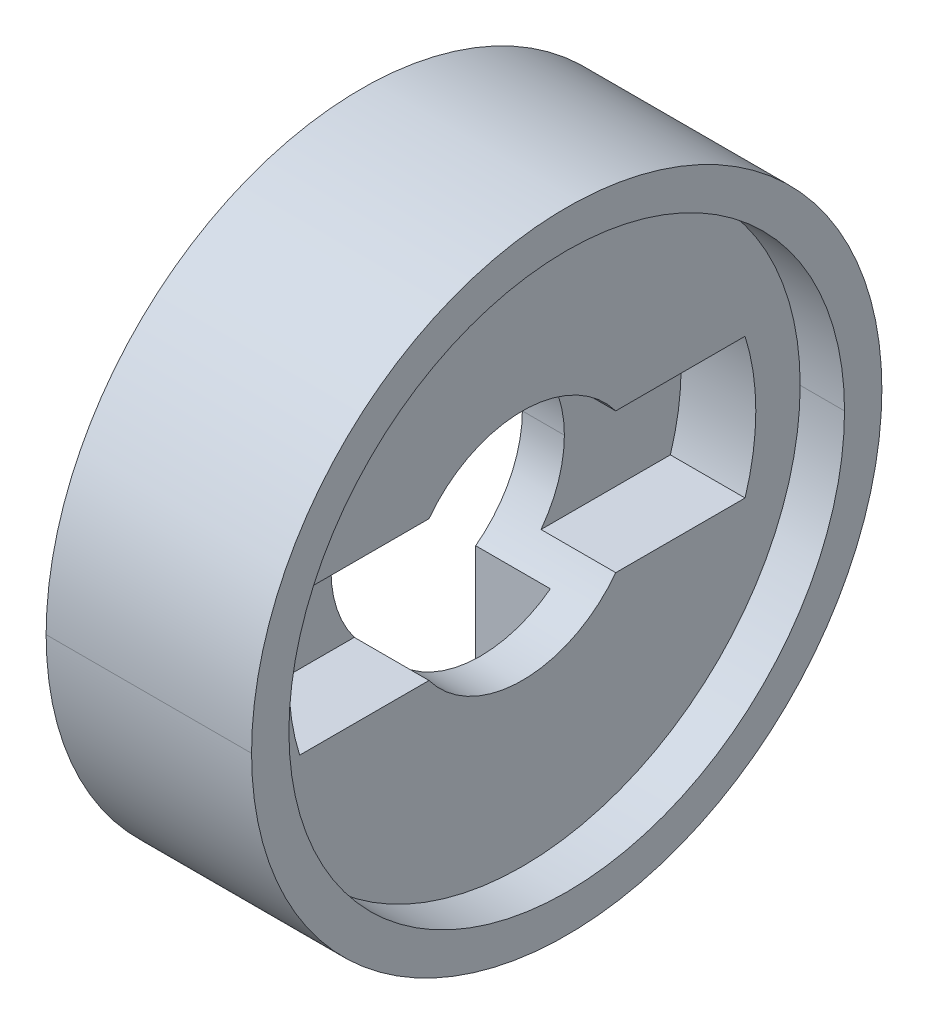
ISO-10303-21;
HEADER;
FILE_DESCRIPTION(('STEP AP214'),'2;1');
FILE_NAME('part.step','',(''),(''),'','','');
FILE_SCHEMA(('AUTOMOTIVE_DESIGN { 1 0 10303 214 1 1 1 1 }'));
ENDSEC;
DATA;
#1=APPLICATION_CONTEXT('core data for automotive mechanical design processes');
#2=APPLICATION_PROTOCOL_DEFINITION('international standard','automotive_design',2000,#1);
#3=PRODUCT_CONTEXT('',#1,'mechanical');
#4=PRODUCT('Part','Part','',(#3));
#5=PRODUCT_RELATED_PRODUCT_CATEGORY('part','',(#4));
#6=PRODUCT_DEFINITION_FORMATION('','',#4);
#7=PRODUCT_DEFINITION_CONTEXT('part definition',#1,'design');
#8=PRODUCT_DEFINITION('design','',#6,#7);
#9=PRODUCT_DEFINITION_SHAPE('','',#8);
#10=(LENGTH_UNIT() NAMED_UNIT(*) SI_UNIT(.MILLI.,.METRE.));
#11=(NAMED_UNIT(*) PLANE_ANGLE_UNIT() SI_UNIT($,.RADIAN.));
#12=(NAMED_UNIT(*) SI_UNIT($,.STERADIAN.) SOLID_ANGLE_UNIT());
#13=UNCERTAINTY_MEASURE_WITH_UNIT(LENGTH_MEASURE(1.E-05),#10,'distance_accuracy_value','');
#14=(GEOMETRIC_REPRESENTATION_CONTEXT(3) GLOBAL_UNCERTAINTY_ASSIGNED_CONTEXT((#13)) GLOBAL_UNIT_ASSIGNED_CONTEXT((#10,
#11,#12)) REPRESENTATION_CONTEXT('',''));
#15=CARTESIAN_POINT('',(0.,0.,0.));
#16=DIRECTION('',(0.,0.,1.));
#17=DIRECTION('',(1.,0.,0.));
#18=AXIS2_PLACEMENT_3D('',#15,#16,#17);
#19=CARTESIAN_POINT('',(10.2,9.5393920141695,3.));
#20=DIRECTION('',(0.,0.,-1.));
#21=DIRECTION('',(-1.,0.,0.));
#22=AXIS2_PLACEMENT_3D('',#19,#20,#21);
#23=PLANE('',#22);
#24=DIRECTION('',(0.,-1.,0.));
#25=VECTOR('',#24,1.);
#26=CARTESIAN_POINT('',(10.2,9.5393920141695,3.));
#27=LINE('',#26,#25);
#28=CARTESIAN_POINT('',(10.2,9.5393920141695,3.));
#29=VERTEX_POINT('',#28);
#30=CARTESIAN_POINT('',(10.2,4.,3.));
#31=VERTEX_POINT('',#30);
#32=EDGE_CURVE('E11',#29,#31,#27,.T.);
#33=ORIENTED_EDGE('',*,*,#32,.T.);
#34=DIRECTION('',(-1.,0.,0.));
#35=VECTOR('',#34,1.);
#36=CARTESIAN_POINT('',(12.2,4.,3.));
#37=LINE('',#36,#35);
#38=CARTESIAN_POINT('',(7.,4.,3.));
#39=VERTEX_POINT('',#38);
#40=EDGE_CURVE('E25',#31,#39,#37,.T.);
#41=ORIENTED_EDGE('',*,*,#40,.T.);
#42=DIRECTION('',(0.,1.,0.));
#43=VECTOR('',#42,1.);
#44=CARTESIAN_POINT('',(7.,0.,3.));
#45=LINE('',#44,#43);
#46=CARTESIAN_POINT('',(7.,9.5393920141695,3.));
#47=VERTEX_POINT('',#46);
#48=EDGE_CURVE('E490',#39,#47,#45,.T.);
#49=ORIENTED_EDGE('',*,*,#48,.T.);
#50=DIRECTION('',(-1.,0.,0.));
#51=VECTOR('',#50,1.);
#52=CARTESIAN_POINT('',(10.2,9.5393920141695,3.));
#53=LINE('',#52,#51);
#54=EDGE_CURVE('E485',#29,#47,#53,.T.);
#55=ORIENTED_EDGE('',*,*,#54,.F.);
#56=EDGE_LOOP('',(#33,#41,#49,#55));
#57=FACE_BOUND('',#56,.T.);
#58=ADVANCED_FACE('F17',(#57),#23,.T.);
#59=CARTESIAN_POINT('',(10.2,-9.24607612695638E-13,0.));
#60=DIRECTION('',(-1.,0.,0.));
#61=DIRECTION('',(0.,-1.,0.));
#62=AXIS2_PLACEMENT_3D('',#59,#60,#61);
#63=CYLINDRICAL_SURFACE('',#62,10.0000000000009);
#64=ORIENTED_EDGE('',*,*,#54,.T.);
#65=CARTESIAN_POINT('',(7.,-9.24607612695638E-13,0.));
#66=DIRECTION('',(-1.,0.,0.));
#67=DIRECTION('',(0.,0.,-1.));
#68=AXIS2_PLACEMENT_3D('',#65,#66,#67);
#69=CIRCLE('',#68,10.0000000000009);
#70=CARTESIAN_POINT('',(7.,9.5393920141695,-3.));
#71=VERTEX_POINT('',#70);
#72=EDGE_CURVE('E481',#47,#71,#69,.T.);
#73=ORIENTED_EDGE('',*,*,#72,.T.);
#74=DIRECTION('',(-1.,0.,0.));
#75=VECTOR('',#74,1.);
#76=CARTESIAN_POINT('',(10.2,9.5393920141695,-3.));
#77=LINE('',#76,#75);
#78=CARTESIAN_POINT('',(10.2,9.5393920141695,-3.));
#79=VERTEX_POINT('',#78);
#80=EDGE_CURVE('E476',#79,#71,#77,.T.);
#81=ORIENTED_EDGE('',*,*,#80,.F.);
#82=CARTESIAN_POINT('',(10.2,-9.24607612695638E-13,0.));
#83=DIRECTION('',(1.,0.,0.));
#84=DIRECTION('',(0.,0.,-1.));
#85=AXIS2_PLACEMENT_3D('',#82,#83,#84);
#86=CIRCLE('',#85,10.0000000000009);
#87=EDGE_CURVE('E471',#79,#29,#86,.T.);
#88=ORIENTED_EDGE('',*,*,#87,.T.);
#89=EDGE_LOOP('',(#64,#73,#81,#88));
#90=FACE_BOUND('',#89,.T.);
#91=ADVANCED_FACE('F506',(#90),#63,.F.);
#92=CARTESIAN_POINT('',(10.2,-9.24607612695638E-13,0.));
#93=DIRECTION('',(1.,0.,0.));
#94=DIRECTION('',(0.,0.,-1.));
#95=AXIS2_PLACEMENT_3D('',#92,#93,#94);
#96=PLANE('',#95);
#97=CARTESIAN_POINT('',(10.2,0.,0.));
#98=DIRECTION('',(-1.,0.,0.));
#99=DIRECTION('',(0.,0.,-1.));
#100=AXIS2_PLACEMENT_3D('',#97,#98,#99);
#101=CIRCLE('',#100,5.);
#102=CARTESIAN_POINT('',(10.2,4.,-3.));
#103=VERTEX_POINT('',#102);
#104=EDGE_CURVE('E466',#31,#103,#101,.T.);
#105=ORIENTED_EDGE('',*,*,#104,.F.);
#106=ORIENTED_EDGE('',*,*,#32,.F.);
#107=ORIENTED_EDGE('',*,*,#87,.F.);
#108=DIRECTION('',(0.,1.,0.));
#109=VECTOR('',#108,1.);
#110=CARTESIAN_POINT('',(10.2,-9.5393920141695,-3.));
#111=LINE('',#110,#109);
#112=EDGE_CURVE('E461',#103,#79,#111,.T.);
#113=ORIENTED_EDGE('',*,*,#112,.F.);
#114=EDGE_LOOP('',(#105,#106,#107,#113));
#115=FACE_BOUND('',#114,.T.);
#116=ADVANCED_FACE('F509',(#115),#96,.F.);
#117=CARTESIAN_POINT('',(10.2,-9.5393920141695,-3.));
#118=DIRECTION('',(0.,0.,1.));
#119=DIRECTION('',(1.,0.,0.));
#120=AXIS2_PLACEMENT_3D('',#117,#118,#119);
#121=PLANE('',#120);
#122=DIRECTION('',(0.,-1.,0.));
#123=VECTOR('',#122,1.);
#124=CARTESIAN_POINT('',(7.,0.,-3.));
#125=LINE('',#124,#123);
#126=CARTESIAN_POINT('',(7.,4.,-3.));
#127=VERTEX_POINT('',#126);
#128=EDGE_CURVE('E457',#71,#127,#125,.T.);
#129=ORIENTED_EDGE('',*,*,#128,.T.);
#130=DIRECTION('',(1.,0.,0.));
#131=VECTOR('',#130,1.);
#132=CARTESIAN_POINT('',(12.2,4.,-3.));
#133=LINE('',#132,#131);
#134=EDGE_CURVE('E452',#127,#103,#133,.T.);
#135=ORIENTED_EDGE('',*,*,#134,.T.);
#136=ORIENTED_EDGE('',*,*,#112,.T.);
#137=ORIENTED_EDGE('',*,*,#80,.T.);
#138=EDGE_LOOP('',(#129,#135,#136,#137));
#139=FACE_BOUND('',#138,.T.);
#140=ADVANCED_FACE('F532',(#139),#121,.T.);
#141=CARTESIAN_POINT('',(12.2,0.,0.));
#142=DIRECTION('',(1.,0.,0.));
#143=DIRECTION('',(0.,-1.,0.));
#144=AXIS2_PLACEMENT_3D('',#141,#142,#143);
#145=CYLINDRICAL_SURFACE('',#144,5.);
#146=DIRECTION('',(1.,0.,0.));
#147=VECTOR('',#146,1.);
#148=CARTESIAN_POINT('',(7.,0.,5.));
#149=LINE('',#148,#147);
#150=CARTESIAN_POINT('',(7.,0.,5.));
#151=VERTEX_POINT('',#150);
#152=CARTESIAN_POINT('',(8.8,0.,5.));
#153=VERTEX_POINT('',#152);
#154=EDGE_CURVE('E447',#151,#153,#149,.T.);
#155=ORIENTED_EDGE('',*,*,#154,.F.);
#156=CARTESIAN_POINT('',(7.,0.,0.));
#157=DIRECTION('',(-1.,0.,0.));
#158=DIRECTION('',(0.,0.,-1.));
#159=AXIS2_PLACEMENT_3D('',#156,#157,#158);
#160=CIRCLE('',#159,5.);
#161=EDGE_CURVE('E443',#151,#39,#160,.T.);
#162=ORIENTED_EDGE('',*,*,#161,.T.);
#163=ORIENTED_EDGE('',*,*,#40,.F.);
#164=ORIENTED_EDGE('',*,*,#104,.T.);
#165=ORIENTED_EDGE('',*,*,#134,.F.);
#166=CARTESIAN_POINT('',(7.,0.,0.));
#167=DIRECTION('',(-1.,0.,0.));
#168=DIRECTION('',(0.,0.,-1.));
#169=AXIS2_PLACEMENT_3D('',#166,#167,#168);
#170=CIRCLE('',#169,5.);
#171=CARTESIAN_POINT('',(7.,0.,-5.));
#172=VERTEX_POINT('',#171);
#173=EDGE_CURVE('E439',#127,#172,#170,.T.);
#174=ORIENTED_EDGE('',*,*,#173,.T.);
#175=DIRECTION('',(1.,0.,0.));
#176=VECTOR('',#175,1.);
#177=CARTESIAN_POINT('',(7.,0.,-5.));
#178=LINE('',#177,#176);
#179=CARTESIAN_POINT('',(8.8,0.,-5.));
#180=VERTEX_POINT('',#179);
#181=EDGE_CURVE('E435',#172,#180,#178,.T.);
#182=ORIENTED_EDGE('',*,*,#181,.T.);
#183=CARTESIAN_POINT('',(8.8,0.,0.));
#184=DIRECTION('',(-1.,0.,0.));
#185=DIRECTION('',(0.,0.,-1.));
#186=AXIS2_PLACEMENT_3D('',#183,#184,#185);
#187=CIRCLE('',#186,5.);
#188=CARTESIAN_POINT('',(8.8,3.,-4.));
#189=VERTEX_POINT('',#188);
#190=EDGE_CURVE('E431',#189,#180,#187,.T.);
#191=ORIENTED_EDGE('',*,*,#190,.F.);
#192=DIRECTION('',(1.,0.,0.));
#193=VECTOR('',#192,1.);
#194=CARTESIAN_POINT('',(12.2,3.,-4.));
#195=LINE('',#194,#193);
#196=CARTESIAN_POINT('',(12.,3.,-4.));
#197=VERTEX_POINT('',#196);
#198=EDGE_CURVE('E198',#189,#197,#195,.T.);
#199=ORIENTED_EDGE('',*,*,#198,.T.);
#200=CARTESIAN_POINT('',(12.,0.,0.));
#201=DIRECTION('',(1.,0.,0.));
#202=DIRECTION('',(0.,0.,1.));
#203=AXIS2_PLACEMENT_3D('',#200,#201,#202);
#204=CIRCLE('',#203,5.);
#205=CARTESIAN_POINT('',(12.,3.,4.));
#206=VERTEX_POINT('',#205);
#207=EDGE_CURVE('E424',#197,#206,#204,.T.);
#208=ORIENTED_EDGE('',*,*,#207,.T.);
#209=DIRECTION('',(-1.,0.,0.));
#210=VECTOR('',#209,1.);
#211=CARTESIAN_POINT('',(12.2,3.,4.));
#212=LINE('',#211,#210);
#213=CARTESIAN_POINT('',(8.8,3.,4.));
#214=VERTEX_POINT('',#213);
#215=EDGE_CURVE('E420',#206,#214,#212,.T.);
#216=ORIENTED_EDGE('',*,*,#215,.T.);
#217=CARTESIAN_POINT('',(8.8,0.,0.));
#218=DIRECTION('',(-1.,0.,0.));
#219=DIRECTION('',(0.,0.,-1.));
#220=AXIS2_PLACEMENT_3D('',#217,#218,#219);
#221=CIRCLE('',#220,5.);
#222=EDGE_CURVE('E415',#153,#214,#221,.T.);
#223=ORIENTED_EDGE('',*,*,#222,.F.);
#224=EDGE_LOOP('',(#155,#162,#163,#164,#165,#174,#182,#191,#199,#208,#216,#223));
#225=FACE_BOUND('',#224,.T.);
#226=ADVANCED_FACE('F512',(#225),#145,.F.);
#227=CARTESIAN_POINT('',(8.8,0.,-9.24607612695638E-13));
#228=DIRECTION('',(1.,0.,0.));
#229=DIRECTION('',(0.,0.,-1.));
#230=AXIS2_PLACEMENT_3D('',#227,#228,#229);
#231=PLANE('',#230);
#232=DIRECTION('',(0.,0.,-1.));
#233=VECTOR('',#232,1.);
#234=CARTESIAN_POINT('',(8.8,-3.,9.5393920141695));
#235=LINE('',#234,#233);
#236=CARTESIAN_POINT('',(8.8,-3.,9.5393920141695));
#237=VERTEX_POINT('',#236);
#238=CARTESIAN_POINT('',(8.8,-3.,4.));
#239=VERTEX_POINT('',#238);
#240=EDGE_CURVE('E411',#237,#239,#235,.T.);
#241=ORIENTED_EDGE('',*,*,#240,.T.);
#242=CARTESIAN_POINT('',(8.8,0.,0.));
#243=DIRECTION('',(-1.,0.,0.));
#244=DIRECTION('',(0.,0.,-1.));
#245=AXIS2_PLACEMENT_3D('',#242,#243,#244);
#246=CIRCLE('',#245,5.);
#247=EDGE_CURVE('E406',#239,#153,#246,.T.);
#248=ORIENTED_EDGE('',*,*,#247,.T.);
#249=ORIENTED_EDGE('',*,*,#222,.T.);
#250=DIRECTION('',(0.,0.,1.));
#251=VECTOR('',#250,1.);
#252=CARTESIAN_POINT('',(8.8,3.,-9.5393920141695));
#253=LINE('',#252,#251);
#254=CARTESIAN_POINT('',(8.8,3.,9.5393920141695));
#255=VERTEX_POINT('',#254);
#256=EDGE_CURVE('E402',#214,#255,#253,.T.);
#257=ORIENTED_EDGE('',*,*,#256,.T.);
#258=CARTESIAN_POINT('',(8.8,0.,-9.24607612695638E-13));
#259=DIRECTION('',(1.,0.,0.));
#260=DIRECTION('',(0.,0.,-1.));
#261=AXIS2_PLACEMENT_3D('',#258,#259,#260);
#262=CIRCLE('',#261,10.0000000000009);
#263=EDGE_CURVE('E398',#255,#237,#262,.T.);
#264=ORIENTED_EDGE('',*,*,#263,.T.);
#265=EDGE_LOOP('',(#241,#248,#249,#257,#264));
#266=FACE_BOUND('',#265,.T.);
#267=ADVANCED_FACE('F540',(#266),#231,.T.);
#268=CARTESIAN_POINT('',(8.8,0.,-9.24607612695638E-13));
#269=DIRECTION('',(1.,0.,0.));
#270=DIRECTION('',(0.,0.,-1.));
#271=AXIS2_PLACEMENT_3D('',#268,#269,#270);
#272=CYLINDRICAL_SURFACE('',#271,10.0000000000009);
#273=DIRECTION('',(1.,0.,0.));
#274=VECTOR('',#273,1.);
#275=CARTESIAN_POINT('',(8.8,-3.,9.5393920141695));
#276=LINE('',#275,#274);
#277=CARTESIAN_POINT('',(12.,-3.,9.5393920141695));
#278=VERTEX_POINT('',#277);
#279=EDGE_CURVE('E393',#237,#278,#276,.T.);
#280=ORIENTED_EDGE('',*,*,#279,.F.);
#281=ORIENTED_EDGE('',*,*,#263,.F.);
#282=DIRECTION('',(1.,0.,0.));
#283=VECTOR('',#282,1.);
#284=CARTESIAN_POINT('',(8.8,3.,9.5393920141695));
#285=LINE('',#284,#283);
#286=CARTESIAN_POINT('',(12.,3.,9.5393920141695));
#287=VERTEX_POINT('',#286);
#288=EDGE_CURVE('E389',#255,#287,#285,.T.);
#289=ORIENTED_EDGE('',*,*,#288,.T.);
#290=CARTESIAN_POINT('',(12.,0.,-9.24607612695638E-13));
#291=DIRECTION('',(-1.,0.,0.));
#292=DIRECTION('',(0.,0.,1.));
#293=AXIS2_PLACEMENT_3D('',#290,#291,#292);
#294=CIRCLE('',#293,10.0000000000009);
#295=EDGE_CURVE('E384',#278,#287,#294,.T.);
#296=ORIENTED_EDGE('',*,*,#295,.F.);
#297=EDGE_LOOP('',(#280,#281,#289,#296));
#298=FACE_BOUND('',#297,.T.);
#299=ADVANCED_FACE('F580',(#298),#272,.F.);
#300=CARTESIAN_POINT('',(12.,11.9,0.));
#301=DIRECTION('',(-1.,0.,0.));
#302=DIRECTION('',(0.,0.,1.));
#303=AXIS2_PLACEMENT_3D('',#300,#301,#302);
#304=PLANE('',#303);
#305=ORIENTED_EDGE('',*,*,#207,.F.);
#306=DIRECTION('',(0.,0.,-1.));
#307=VECTOR('',#306,1.);
#308=CARTESIAN_POINT('',(12.,3.,0.));
#309=LINE('',#308,#307);
#310=CARTESIAN_POINT('',(12.,3.,-9.5393920141695));
#311=VERTEX_POINT('',#310);
#312=EDGE_CURVE('E380',#197,#311,#309,.T.);
#313=ORIENTED_EDGE('',*,*,#312,.T.);
#314=CARTESIAN_POINT('',(12.,0.,9.24607612695638E-13));
#315=DIRECTION('',(-1.,0.,0.));
#316=DIRECTION('',(0.,0.,1.));
#317=AXIS2_PLACEMENT_3D('',#314,#315,#316);
#318=CIRCLE('',#317,10.0000000000009);
#319=CARTESIAN_POINT('',(12.,-3.,-9.5393920141695));
#320=VERTEX_POINT('',#319);
#321=EDGE_CURVE('E192',#311,#320,#318,.T.);
#322=ORIENTED_EDGE('',*,*,#321,.T.);
#323=DIRECTION('',(0.,0.,1.));
#324=VECTOR('',#323,1.);
#325=CARTESIAN_POINT('',(12.,-3.,0.));
#326=LINE('',#325,#324);
#327=CARTESIAN_POINT('',(12.,-3.,-4.));
#328=VERTEX_POINT('',#327);
#329=EDGE_CURVE('E373',#320,#328,#326,.T.);
#330=ORIENTED_EDGE('',*,*,#329,.T.);
#331=CARTESIAN_POINT('',(12.,0.,0.));
#332=DIRECTION('',(1.,0.,0.));
#333=DIRECTION('',(0.,0.,1.));
#334=AXIS2_PLACEMENT_3D('',#331,#332,#333);
#335=CIRCLE('',#334,5.);
#336=CARTESIAN_POINT('',(12.,-3.,4.));
#337=VERTEX_POINT('',#336);
#338=EDGE_CURVE('E368',#337,#328,#335,.T.);
#339=ORIENTED_EDGE('',*,*,#338,.F.);
#340=DIRECTION('',(0.,0.,1.));
#341=VECTOR('',#340,1.);
#342=CARTESIAN_POINT('',(12.,-3.,0.));
#343=LINE('',#342,#341);
#344=EDGE_CURVE('E363',#337,#278,#343,.T.);
#345=ORIENTED_EDGE('',*,*,#344,.T.);
#346=ORIENTED_EDGE('',*,*,#295,.T.);
#347=DIRECTION('',(0.,0.,-1.));
#348=VECTOR('',#347,1.);
#349=CARTESIAN_POINT('',(12.,3.,0.));
#350=LINE('',#349,#348);
#351=EDGE_CURVE('E358',#287,#206,#350,.T.);
#352=ORIENTED_EDGE('',*,*,#351,.T.);
#353=EDGE_LOOP('',(#305,#313,#322,#330,#339,#345,#346,#352));
#354=FACE_BOUND('',#353,.T.);
#355=CARTESIAN_POINT('',(12.,0.,0.));
#356=DIRECTION('',(1.,0.,0.));
#357=DIRECTION('',(0.,0.,-1.));
#358=AXIS2_PLACEMENT_3D('',#355,#356,#357);
#359=CIRCLE('',#358,11.9);
#360=CARTESIAN_POINT('',(12.,0.,-11.9));
#361=VERTEX_POINT('',#360);
#362=CARTESIAN_POINT('',(12.,0.,11.9));
#363=VERTEX_POINT('',#362);
#364=EDGE_CURVE('E354',#361,#363,#359,.T.);
#365=ORIENTED_EDGE('',*,*,#364,.T.);
#366=CARTESIAN_POINT('',(12.,0.,0.));
#367=DIRECTION('',(1.,0.,0.));
#368=DIRECTION('',(0.,0.,-1.));
#369=AXIS2_PLACEMENT_3D('',#366,#367,#368);
#370=CIRCLE('',#369,11.9);
#371=EDGE_CURVE('E350',#363,#361,#370,.T.);
#372=ORIENTED_EDGE('',*,*,#371,.T.);
#373=EDGE_LOOP('',(#365,#372));
#374=FACE_BOUND('',#373,.T.);
#375=ADVANCED_FACE('F591',(#354,#374),#304,.F.);
#376=CARTESIAN_POINT('',(12.,0.,0.));
#377=DIRECTION('',(1.,0.,0.));
#378=DIRECTION('',(0.,1.,0.));
#379=AXIS2_PLACEMENT_3D('',#376,#377,#378);
#380=CYLINDRICAL_SURFACE('',#379,11.9);
#381=DIRECTION('',(1.,0.,0.));
#382=VECTOR('',#381,1.);
#383=CARTESIAN_POINT('',(12.,0.,11.9));
#384=LINE('',#383,#382);
#385=CARTESIAN_POINT('',(13.9,0.,11.9));
#386=VERTEX_POINT('',#385);
#387=EDGE_CURVE('E346',#363,#386,#384,.T.);
#388=ORIENTED_EDGE('',*,*,#387,.T.);
#389=CARTESIAN_POINT('',(13.9,0.,0.));
#390=DIRECTION('',(1.,0.,0.));
#391=DIRECTION('',(0.,0.,-1.));
#392=AXIS2_PLACEMENT_3D('',#389,#390,#391);
#393=CIRCLE('',#392,11.9);
#394=CARTESIAN_POINT('',(13.9,0.,-11.9));
#395=VERTEX_POINT('',#394);
#396=EDGE_CURVE('E342',#386,#395,#393,.T.);
#397=ORIENTED_EDGE('',*,*,#396,.T.);
#398=DIRECTION('',(1.,0.,0.));
#399=VECTOR('',#398,1.);
#400=CARTESIAN_POINT('',(12.,0.,-11.9));
#401=LINE('',#400,#399);
#402=EDGE_CURVE('E337',#361,#395,#401,.T.);
#403=ORIENTED_EDGE('',*,*,#402,.F.);
#404=ORIENTED_EDGE('',*,*,#371,.F.);
#405=EDGE_LOOP('',(#388,#397,#403,#404));
#406=FACE_BOUND('',#405,.T.);
#407=ADVANCED_FACE('F602',(#406),#380,.F.);
#408=CARTESIAN_POINT('',(12.,0.,0.));
#409=DIRECTION('',(1.,0.,0.));
#410=DIRECTION('',(0.,-1.,0.));
#411=AXIS2_PLACEMENT_3D('',#408,#409,#410);
#412=CYLINDRICAL_SURFACE('',#411,11.9);
#413=ORIENTED_EDGE('',*,*,#387,.F.);
#414=ORIENTED_EDGE('',*,*,#364,.F.);
#415=ORIENTED_EDGE('',*,*,#402,.T.);
#416=CARTESIAN_POINT('',(13.9,0.,0.));
#417=DIRECTION('',(1.,0.,0.));
#418=DIRECTION('',(0.,0.,-1.));
#419=AXIS2_PLACEMENT_3D('',#416,#417,#418);
#420=CIRCLE('',#419,11.9);
#421=EDGE_CURVE('E332',#395,#386,#420,.T.);
#422=ORIENTED_EDGE('',*,*,#421,.T.);
#423=EDGE_LOOP('',(#413,#414,#415,#422));
#424=FACE_BOUND('',#423,.T.);
#425=ADVANCED_FACE('F613',(#424),#412,.F.);
#426=CARTESIAN_POINT('',(13.9,13.5,0.));
#427=DIRECTION('',(-1.,0.,0.));
#428=DIRECTION('',(0.,0.,1.));
#429=AXIS2_PLACEMENT_3D('',#426,#427,#428);
#430=PLANE('',#429);
#431=ORIENTED_EDGE('',*,*,#396,.F.);
#432=ORIENTED_EDGE('',*,*,#421,.F.);
#433=EDGE_LOOP('',(#431,#432));
#434=FACE_BOUND('',#433,.T.);
#435=CARTESIAN_POINT('',(13.9,0.,0.));
#436=DIRECTION('',(1.,0.,0.));
#437=DIRECTION('',(0.,0.,-1.));
#438=AXIS2_PLACEMENT_3D('',#435,#436,#437);
#439=CIRCLE('',#438,13.5);
#440=CARTESIAN_POINT('',(13.9,0.,-13.5));
#441=VERTEX_POINT('',#440);
#442=CARTESIAN_POINT('',(13.9,0.,13.5));
#443=VERTEX_POINT('',#442);
#444=EDGE_CURVE('E328',#441,#443,#439,.T.);
#445=ORIENTED_EDGE('',*,*,#444,.T.);
#446=CARTESIAN_POINT('',(13.9,0.,0.));
#447=DIRECTION('',(1.,0.,0.));
#448=DIRECTION('',(0.,0.,-1.));
#449=AXIS2_PLACEMENT_3D('',#446,#447,#448);
#450=CIRCLE('',#449,13.5);
#451=EDGE_CURVE('E324',#443,#441,#450,.T.);
#452=ORIENTED_EDGE('',*,*,#451,.T.);
#453=EDGE_LOOP('',(#445,#452));
#454=FACE_BOUND('',#453,.T.);
#455=ADVANCED_FACE('F624',(#434,#454),#430,.F.);
#456=CARTESIAN_POINT('',(12.,0.,0.));
#457=DIRECTION('',(1.,0.,0.));
#458=DIRECTION('',(0.,1.,0.));
#459=AXIS2_PLACEMENT_3D('',#456,#457,#458);
#460=CYLINDRICAL_SURFACE('',#459,13.5);
#461=DIRECTION('',(1.,0.,0.));
#462=VECTOR('',#461,1.);
#463=CARTESIAN_POINT('',(5.1,0.,13.5));
#464=LINE('',#463,#462);
#465=CARTESIAN_POINT('',(5.1,0.,13.5));
#466=VERTEX_POINT('',#465);
#467=EDGE_CURVE('E319',#466,#443,#464,.T.);
#468=ORIENTED_EDGE('',*,*,#467,.F.);
#469=CARTESIAN_POINT('',(5.1,0.,0.));
#470=DIRECTION('',(1.,0.,0.));
#471=DIRECTION('',(0.,0.,-1.));
#472=AXIS2_PLACEMENT_3D('',#469,#470,#471);
#473=CIRCLE('',#472,13.5);
#474=CARTESIAN_POINT('',(5.1,0.,-13.5));
#475=VERTEX_POINT('',#474);
#476=EDGE_CURVE('E315',#466,#475,#473,.T.);
#477=ORIENTED_EDGE('',*,*,#476,.T.);
#478=DIRECTION('',(1.,0.,0.));
#479=VECTOR('',#478,1.);
#480=CARTESIAN_POINT('',(5.1,0.,-13.5));
#481=LINE('',#480,#479);
#482=EDGE_CURVE('E310',#475,#441,#481,.T.);
#483=ORIENTED_EDGE('',*,*,#482,.T.);
#484=ORIENTED_EDGE('',*,*,#451,.F.);
#485=EDGE_LOOP('',(#468,#477,#483,#484));
#486=FACE_BOUND('',#485,.T.);
#487=ADVANCED_FACE('F635',(#486),#460,.T.);
#488=CARTESIAN_POINT('',(12.,0.,0.));
#489=DIRECTION('',(1.,0.,0.));
#490=DIRECTION('',(0.,-1.,0.));
#491=AXIS2_PLACEMENT_3D('',#488,#489,#490);
#492=CYLINDRICAL_SURFACE('',#491,13.5);
#493=ORIENTED_EDGE('',*,*,#467,.T.);
#494=ORIENTED_EDGE('',*,*,#444,.F.);
#495=ORIENTED_EDGE('',*,*,#482,.F.);
#496=CARTESIAN_POINT('',(5.1,0.,0.));
#497=DIRECTION('',(1.,0.,0.));
#498=DIRECTION('',(0.,0.,-1.));
#499=AXIS2_PLACEMENT_3D('',#496,#497,#498);
#500=CIRCLE('',#499,13.5);
#501=EDGE_CURVE('E305',#475,#466,#500,.T.);
#502=ORIENTED_EDGE('',*,*,#501,.T.);
#503=EDGE_LOOP('',(#493,#494,#495,#502));
#504=FACE_BOUND('',#503,.T.);
#505=ADVANCED_FACE('F646',(#504),#492,.T.);
#506=CARTESIAN_POINT('',(5.1,11.9,0.));
#507=DIRECTION('',(1.,0.,0.));
#508=DIRECTION('',(0.,0.,-1.));
#509=AXIS2_PLACEMENT_3D('',#506,#507,#508);
#510=PLANE('',#509);
#511=ORIENTED_EDGE('',*,*,#476,.F.);
#512=ORIENTED_EDGE('',*,*,#501,.F.);
#513=EDGE_LOOP('',(#511,#512));
#514=FACE_BOUND('',#513,.T.);
#515=CARTESIAN_POINT('',(5.1,0.,0.));
#516=DIRECTION('',(1.,0.,0.));
#517=DIRECTION('',(0.,0.,-1.));
#518=AXIS2_PLACEMENT_3D('',#515,#516,#517);
#519=CIRCLE('',#518,11.9);
#520=CARTESIAN_POINT('',(5.1,0.,-11.9));
#521=VERTEX_POINT('',#520);
#522=CARTESIAN_POINT('',(5.1,0.,11.9));
#523=VERTEX_POINT('',#522);
#524=EDGE_CURVE('E301',#521,#523,#519,.T.);
#525=ORIENTED_EDGE('',*,*,#524,.T.);
#526=CARTESIAN_POINT('',(5.1,0.,0.));
#527=DIRECTION('',(1.,0.,0.));
#528=DIRECTION('',(0.,0.,-1.));
#529=AXIS2_PLACEMENT_3D('',#526,#527,#528);
#530=CIRCLE('',#529,11.9);
#531=EDGE_CURVE('E297',#523,#521,#530,.T.);
#532=ORIENTED_EDGE('',*,*,#531,.T.);
#533=EDGE_LOOP('',(#525,#532));
#534=FACE_BOUND('',#533,.T.);
#535=ADVANCED_FACE('F657',(#514,#534),#510,.F.);
#536=CARTESIAN_POINT('',(12.,0.,0.));
#537=DIRECTION('',(1.,0.,0.));
#538=DIRECTION('',(0.,1.,0.));
#539=AXIS2_PLACEMENT_3D('',#536,#537,#538);
#540=CYLINDRICAL_SURFACE('',#539,11.9);
#541=DIRECTION('',(1.,0.,0.));
#542=VECTOR('',#541,1.);
#543=CARTESIAN_POINT('',(5.1,0.,11.9));
#544=LINE('',#543,#542);
#545=CARTESIAN_POINT('',(7.,0.,11.9));
#546=VERTEX_POINT('',#545);
#547=EDGE_CURVE('E293',#523,#546,#544,.T.);
#548=ORIENTED_EDGE('',*,*,#547,.T.);
#549=CARTESIAN_POINT('',(7.,0.,0.));
#550=DIRECTION('',(1.,0.,0.));
#551=DIRECTION('',(0.,0.,-1.));
#552=AXIS2_PLACEMENT_3D('',#549,#550,#551);
#553=CIRCLE('',#552,11.9);
#554=CARTESIAN_POINT('',(7.,0.,-11.9));
#555=VERTEX_POINT('',#554);
#556=EDGE_CURVE('E289',#546,#555,#553,.T.);
#557=ORIENTED_EDGE('',*,*,#556,.T.);
#558=DIRECTION('',(1.,0.,0.));
#559=VECTOR('',#558,1.);
#560=CARTESIAN_POINT('',(5.1,0.,-11.9));
#561=LINE('',#560,#559);
#562=EDGE_CURVE('E284',#521,#555,#561,.T.);
#563=ORIENTED_EDGE('',*,*,#562,.F.);
#564=ORIENTED_EDGE('',*,*,#531,.F.);
#565=EDGE_LOOP('',(#548,#557,#563,#564));
#566=FACE_BOUND('',#565,.T.);
#567=ADVANCED_FACE('F668',(#566),#540,.F.);
#568=CARTESIAN_POINT('',(12.,0.,0.));
#569=DIRECTION('',(1.,0.,0.));
#570=DIRECTION('',(0.,-1.,0.));
#571=AXIS2_PLACEMENT_3D('',#568,#569,#570);
#572=CYLINDRICAL_SURFACE('',#571,11.9);
#573=ORIENTED_EDGE('',*,*,#547,.F.);
#574=ORIENTED_EDGE('',*,*,#524,.F.);
#575=ORIENTED_EDGE('',*,*,#562,.T.);
#576=CARTESIAN_POINT('',(7.,0.,0.));
#577=DIRECTION('',(1.,0.,0.));
#578=DIRECTION('',(0.,0.,-1.));
#579=AXIS2_PLACEMENT_3D('',#576,#577,#578);
#580=CIRCLE('',#579,11.9);
#581=EDGE_CURVE('E279',#555,#546,#580,.T.);
#582=ORIENTED_EDGE('',*,*,#581,.T.);
#583=EDGE_LOOP('',(#573,#574,#575,#582));
#584=FACE_BOUND('',#583,.T.);
#585=ADVANCED_FACE('F679',(#584),#572,.F.);
#586=CARTESIAN_POINT('',(7.,0.,0.));
#587=DIRECTION('',(1.,0.,0.));
#588=DIRECTION('',(0.,0.,-1.));
#589=AXIS2_PLACEMENT_3D('',#586,#587,#588);
#590=PLANE('',#589);
#591=ORIENTED_EDGE('',*,*,#556,.F.);
#592=ORIENTED_EDGE('',*,*,#581,.F.);
#593=EDGE_LOOP('',(#591,#592));
#594=FACE_BOUND('',#593,.T.);
#595=ORIENTED_EDGE('',*,*,#161,.F.);
#596=CARTESIAN_POINT('',(7.,0.,0.));
#597=DIRECTION('',(-1.,0.,0.));
#598=DIRECTION('',(0.,0.,-1.));
#599=AXIS2_PLACEMENT_3D('',#596,#597,#598);
#600=CIRCLE('',#599,5.);
#601=CARTESIAN_POINT('',(7.,-4.,3.));
#602=VERTEX_POINT('',#601);
#603=EDGE_CURVE('E274',#602,#151,#600,.T.);
#604=ORIENTED_EDGE('',*,*,#603,.F.);
#605=DIRECTION('',(0.,1.,0.));
#606=VECTOR('',#605,1.);
#607=CARTESIAN_POINT('',(7.,0.,3.));
#608=LINE('',#607,#606);
#609=CARTESIAN_POINT('',(7.,-9.5393920141695,3.));
#610=VERTEX_POINT('',#609);
#611=EDGE_CURVE('E269',#610,#602,#608,.T.);
#612=ORIENTED_EDGE('',*,*,#611,.F.);
#613=CARTESIAN_POINT('',(7.,9.24607612695638E-13,0.));
#614=DIRECTION('',(-1.,0.,0.));
#615=DIRECTION('',(0.,0.,-1.));
#616=AXIS2_PLACEMENT_3D('',#613,#614,#615);
#617=CIRCLE('',#616,10.0000000000009);
#618=CARTESIAN_POINT('',(7.,-9.5393920141695,-3.));
#619=VERTEX_POINT('',#618);
#620=EDGE_CURVE('E264',#619,#610,#617,.T.);
#621=ORIENTED_EDGE('',*,*,#620,.F.);
#622=DIRECTION('',(0.,-1.,0.));
#623=VECTOR('',#622,1.);
#624=CARTESIAN_POINT('',(7.,0.,-3.));
#625=LINE('',#624,#623);
#626=CARTESIAN_POINT('',(7.,-4.,-3.));
#627=VERTEX_POINT('',#626);
#628=EDGE_CURVE('E259',#627,#619,#625,.T.);
#629=ORIENTED_EDGE('',*,*,#628,.F.);
#630=CARTESIAN_POINT('',(7.,0.,0.));
#631=DIRECTION('',(-1.,0.,0.));
#632=DIRECTION('',(0.,0.,-1.));
#633=AXIS2_PLACEMENT_3D('',#630,#631,#632);
#634=CIRCLE('',#633,5.);
#635=EDGE_CURVE('E254',#172,#627,#634,.T.);
#636=ORIENTED_EDGE('',*,*,#635,.F.);
#637=ORIENTED_EDGE('',*,*,#173,.F.);
#638=ORIENTED_EDGE('',*,*,#128,.F.);
#639=ORIENTED_EDGE('',*,*,#72,.F.);
#640=ORIENTED_EDGE('',*,*,#48,.F.);
#641=EDGE_LOOP('',(#595,#604,#612,#621,#629,#636,#637,#638,#639,#640));
#642=FACE_BOUND('',#641,.T.);
#643=ADVANCED_FACE('F503',(#594,#642),#590,.F.);
#644=CARTESIAN_POINT('',(12.2,0.,0.));
#645=DIRECTION('',(1.,0.,0.));
#646=DIRECTION('',(0.,1.,0.));
#647=AXIS2_PLACEMENT_3D('',#644,#645,#646);
#648=CYLINDRICAL_SURFACE('',#647,5.);
#649=ORIENTED_EDGE('',*,*,#154,.T.);
#650=ORIENTED_EDGE('',*,*,#247,.F.);
#651=DIRECTION('',(1.,0.,0.));
#652=VECTOR('',#651,1.);
#653=CARTESIAN_POINT('',(12.2,-3.,4.));
#654=LINE('',#653,#652);
#655=EDGE_CURVE('E249',#239,#337,#654,.T.);
#656=ORIENTED_EDGE('',*,*,#655,.T.);
#657=ORIENTED_EDGE('',*,*,#338,.T.);
#658=DIRECTION('',(-1.,0.,0.));
#659=VECTOR('',#658,1.);
#660=CARTESIAN_POINT('',(12.2,-3.,-4.));
#661=LINE('',#660,#659);
#662=CARTESIAN_POINT('',(8.8,-3.,-4.));
#663=VERTEX_POINT('',#662);
#664=EDGE_CURVE('E245',#328,#663,#661,.T.);
#665=ORIENTED_EDGE('',*,*,#664,.T.);
#666=CARTESIAN_POINT('',(8.8,0.,0.));
#667=DIRECTION('',(-1.,0.,0.));
#668=DIRECTION('',(0.,0.,-1.));
#669=AXIS2_PLACEMENT_3D('',#666,#667,#668);
#670=CIRCLE('',#669,5.);
#671=EDGE_CURVE('E241',#180,#663,#670,.T.);
#672=ORIENTED_EDGE('',*,*,#671,.F.);
#673=ORIENTED_EDGE('',*,*,#181,.F.);
#674=ORIENTED_EDGE('',*,*,#635,.T.);
#675=DIRECTION('',(-1.,0.,0.));
#676=VECTOR('',#675,1.);
#677=CARTESIAN_POINT('',(12.2,-4.,-3.));
#678=LINE('',#677,#676);
#679=CARTESIAN_POINT('',(10.2,-4.,-3.));
#680=VERTEX_POINT('',#679);
#681=EDGE_CURVE('E236',#680,#627,#678,.T.);
#682=ORIENTED_EDGE('',*,*,#681,.F.);
#683=CARTESIAN_POINT('',(10.2,0.,0.));
#684=DIRECTION('',(-1.,0.,0.));
#685=DIRECTION('',(0.,0.,-1.));
#686=AXIS2_PLACEMENT_3D('',#683,#684,#685);
#687=CIRCLE('',#686,5.);
#688=CARTESIAN_POINT('',(10.2,-4.,3.));
#689=VERTEX_POINT('',#688);
#690=EDGE_CURVE('E232',#680,#689,#687,.T.);
#691=ORIENTED_EDGE('',*,*,#690,.T.);
#692=DIRECTION('',(1.,0.,0.));
#693=VECTOR('',#692,1.);
#694=CARTESIAN_POINT('',(12.2,-4.,3.));
#695=LINE('',#694,#693);
#696=EDGE_CURVE('E227',#602,#689,#695,.T.);
#697=ORIENTED_EDGE('',*,*,#696,.F.);
#698=ORIENTED_EDGE('',*,*,#603,.T.);
#699=EDGE_LOOP('',(#649,#650,#656,#657,#665,#672,#673,#674,#682,#691,#697,#698));
#700=FACE_BOUND('',#699,.T.);
#701=ADVANCED_FACE('F515',(#700),#648,.F.);
#702=CARTESIAN_POINT('',(10.2,9.5393920141695,3.));
#703=DIRECTION('',(0.,0.,-1.));
#704=DIRECTION('',(-1.,0.,0.));
#705=AXIS2_PLACEMENT_3D('',#702,#703,#704);
#706=PLANE('',#705);
#707=ORIENTED_EDGE('',*,*,#611,.T.);
#708=ORIENTED_EDGE('',*,*,#696,.T.);
#709=DIRECTION('',(0.,-1.,0.));
#710=VECTOR('',#709,1.);
#711=CARTESIAN_POINT('',(10.2,9.5393920141695,3.));
#712=LINE('',#711,#710);
#713=CARTESIAN_POINT('',(10.2,-9.5393920141695,3.));
#714=VERTEX_POINT('',#713);
#715=EDGE_CURVE('E223',#689,#714,#712,.T.);
#716=ORIENTED_EDGE('',*,*,#715,.T.);
#717=DIRECTION('',(-1.,0.,0.));
#718=VECTOR('',#717,1.);
#719=CARTESIAN_POINT('',(10.2,-9.5393920141695,3.));
#720=LINE('',#719,#718);
#721=EDGE_CURVE('E218',#714,#610,#720,.T.);
#722=ORIENTED_EDGE('',*,*,#721,.T.);
#723=EDGE_LOOP('',(#707,#708,#716,#722));
#724=FACE_BOUND('',#723,.T.);
#725=ADVANCED_FACE('F519',(#724),#706,.T.);
#726=CARTESIAN_POINT('',(10.2,9.24607612695638E-13,0.));
#727=DIRECTION('',(-1.,0.,0.));
#728=DIRECTION('',(0.,1.,0.));
#729=AXIS2_PLACEMENT_3D('',#726,#727,#728);
#730=CYLINDRICAL_SURFACE('',#729,10.0000000000009);
#731=ORIENTED_EDGE('',*,*,#620,.T.);
#732=ORIENTED_EDGE('',*,*,#721,.F.);
#733=CARTESIAN_POINT('',(10.2,9.24607612695638E-13,0.));
#734=DIRECTION('',(1.,0.,0.));
#735=DIRECTION('',(0.,0.,-1.));
#736=AXIS2_PLACEMENT_3D('',#733,#734,#735);
#737=CIRCLE('',#736,10.0000000000009);
#738=CARTESIAN_POINT('',(10.2,-9.5393920141695,-3.));
#739=VERTEX_POINT('',#738);
#740=EDGE_CURVE('E214',#714,#739,#737,.T.);
#741=ORIENTED_EDGE('',*,*,#740,.T.);
#742=DIRECTION('',(-1.,0.,0.));
#743=VECTOR('',#742,1.);
#744=CARTESIAN_POINT('',(10.2,-9.5393920141695,-3.));
#745=LINE('',#744,#743);
#746=EDGE_CURVE('E202',#739,#619,#745,.T.);
#747=ORIENTED_EDGE('',*,*,#746,.T.);
#748=EDGE_LOOP('',(#731,#732,#741,#747));
#749=FACE_BOUND('',#748,.T.);
#750=ADVANCED_FACE('F523',(#749),#730,.F.);
#751=CARTESIAN_POINT('',(10.2,-9.5393920141695,-3.));
#752=DIRECTION('',(0.,0.,1.));
#753=DIRECTION('',(1.,0.,0.));
#754=AXIS2_PLACEMENT_3D('',#751,#752,#753);
#755=PLANE('',#754);
#756=DIRECTION('',(0.,1.,0.));
#757=VECTOR('',#756,1.);
#758=CARTESIAN_POINT('',(10.2,-9.5393920141695,-3.));
#759=LINE('',#758,#757);
#760=EDGE_CURVE('E199',#739,#680,#759,.T.);
#761=ORIENTED_EDGE('',*,*,#760,.T.);
#762=ORIENTED_EDGE('',*,*,#681,.T.);
#763=ORIENTED_EDGE('',*,*,#628,.T.);
#764=ORIENTED_EDGE('',*,*,#746,.F.);
#765=EDGE_LOOP('',(#761,#762,#763,#764));
#766=FACE_BOUND('',#765,.T.);
#767=ADVANCED_FACE('F528',(#766),#755,.T.);
#768=CARTESIAN_POINT('',(10.2,-9.24607612695638E-13,0.));
#769=DIRECTION('',(1.,0.,0.));
#770=DIRECTION('',(0.,0.,-1.));
#771=AXIS2_PLACEMENT_3D('',#768,#769,#770);
#772=PLANE('',#771);
#773=ORIENTED_EDGE('',*,*,#690,.F.);
#774=ORIENTED_EDGE('',*,*,#760,.F.);
#775=ORIENTED_EDGE('',*,*,#740,.F.);
#776=ORIENTED_EDGE('',*,*,#715,.F.);
#777=EDGE_LOOP('',(#773,#774,#775,#776));
#778=FACE_BOUND('',#777,.T.);
#779=ADVANCED_FACE('F737',(#778),#772,.F.);
#780=CARTESIAN_POINT('',(8.8,0.,-9.24607612695638E-13));
#781=DIRECTION('',(1.,0.,0.));
#782=DIRECTION('',(0.,0.,-1.));
#783=AXIS2_PLACEMENT_3D('',#780,#781,#782);
#784=PLANE('',#783);
#785=DIRECTION('',(0.,0.,1.));
#786=VECTOR('',#785,1.);
#787=CARTESIAN_POINT('',(8.8,3.,-9.5393920141695));
#788=LINE('',#787,#786);
#789=CARTESIAN_POINT('',(8.8,3.,-9.5393920141695));
#790=VERTEX_POINT('',#789);
#791=EDGE_CURVE('E179',#790,#189,#788,.T.);
#792=ORIENTED_EDGE('',*,*,#791,.T.);
#793=ORIENTED_EDGE('',*,*,#190,.T.);
#794=ORIENTED_EDGE('',*,*,#671,.T.);
#795=DIRECTION('',(0.,0.,-1.));
#796=VECTOR('',#795,1.);
#797=CARTESIAN_POINT('',(8.8,-3.,9.5393920141695));
#798=LINE('',#797,#796);
#799=CARTESIAN_POINT('',(8.8,-3.,-9.5393920141695));
#800=VERTEX_POINT('',#799);
#801=EDGE_CURVE('E183',#663,#800,#798,.T.);
#802=ORIENTED_EDGE('',*,*,#801,.T.);
#803=CARTESIAN_POINT('',(8.8,0.,9.24607612695638E-13));
#804=DIRECTION('',(1.,0.,0.));
#805=DIRECTION('',(0.,0.,-1.));
#806=AXIS2_PLACEMENT_3D('',#803,#804,#805);
#807=CIRCLE('',#806,10.0000000000009);
#808=EDGE_CURVE('E174',#800,#790,#807,.T.);
#809=ORIENTED_EDGE('',*,*,#808,.T.);
#810=EDGE_LOOP('',(#792,#793,#794,#802,#809));
#811=FACE_BOUND('',#810,.T.);
#812=ADVANCED_FACE('F176',(#811),#784,.T.);
#813=CARTESIAN_POINT('',(8.8,0.,9.24607612695638E-13));
#814=DIRECTION('',(1.,0.,0.));
#815=DIRECTION('',(0.,0.,1.));
#816=AXIS2_PLACEMENT_3D('',#813,#814,#815);
#817=CYLINDRICAL_SURFACE('',#816,10.0000000000009);
#818=DIRECTION('',(1.,0.,0.));
#819=VECTOR('',#818,1.);
#820=CARTESIAN_POINT('',(8.8,3.,-9.5393920141695));
#821=LINE('',#820,#819);
#822=EDGE_CURVE('E187',#790,#311,#821,.T.);
#823=ORIENTED_EDGE('',*,*,#822,.F.);
#824=ORIENTED_EDGE('',*,*,#808,.F.);
#825=DIRECTION('',(1.,0.,0.));
#826=VECTOR('',#825,1.);
#827=CARTESIAN_POINT('',(8.8,-3.,-9.5393920141695));
#828=LINE('',#827,#826);
#829=EDGE_CURVE('E195',#800,#320,#828,.T.);
#830=ORIENTED_EDGE('',*,*,#829,.T.);
#831=ORIENTED_EDGE('',*,*,#321,.F.);
#832=EDGE_LOOP('',(#823,#824,#830,#831));
#833=FACE_BOUND('',#832,.T.);
#834=ADVANCED_FACE('F191',(#833),#817,.F.);
#835=CARTESIAN_POINT('',(8.8,-3.,9.5393920141695));
#836=DIRECTION('',(0.,-1.,0.));
#837=DIRECTION('',(0.,0.,-1.));
#838=AXIS2_PLACEMENT_3D('',#835,#836,#837);
#839=PLANE('',#838);
#840=ORIENTED_EDGE('',*,*,#664,.F.);
#841=ORIENTED_EDGE('',*,*,#329,.F.);
#842=ORIENTED_EDGE('',*,*,#829,.F.);
#843=ORIENTED_EDGE('',*,*,#801,.F.);
#844=EDGE_LOOP('',(#840,#841,#842,#843));
#845=FACE_BOUND('',#844,.T.);
#846=ADVANCED_FACE('F766',(#845),#839,.F.);
#847=CARTESIAN_POINT('',(8.8,3.,-9.5393920141695));
#848=DIRECTION('',(0.,1.,0.));
#849=DIRECTION('',(0.,0.,1.));
#850=AXIS2_PLACEMENT_3D('',#847,#848,#849);
#851=PLANE('',#850);
#852=ORIENTED_EDGE('',*,*,#198,.F.);
#853=ORIENTED_EDGE('',*,*,#791,.F.);
#854=ORIENTED_EDGE('',*,*,#822,.T.);
#855=ORIENTED_EDGE('',*,*,#312,.F.);
#856=EDGE_LOOP('',(#852,#853,#854,#855));
#857=FACE_BOUND('',#856,.T.);
#858=ADVANCED_FACE('F197',(#857),#851,.F.);
#859=CARTESIAN_POINT('',(8.8,-3.,9.5393920141695));
#860=DIRECTION('',(0.,-1.,0.));
#861=DIRECTION('',(0.,0.,-1.));
#862=AXIS2_PLACEMENT_3D('',#859,#860,#861);
#863=PLANE('',#862);
#864=ORIENTED_EDGE('',*,*,#655,.F.);
#865=ORIENTED_EDGE('',*,*,#240,.F.);
#866=ORIENTED_EDGE('',*,*,#279,.T.);
#867=ORIENTED_EDGE('',*,*,#344,.F.);
#868=EDGE_LOOP('',(#864,#865,#866,#867));
#869=FACE_BOUND('',#868,.T.);
#870=ADVANCED_FACE('F786',(#869),#863,.F.);
#871=CARTESIAN_POINT('',(8.8,3.,-9.5393920141695));
#872=DIRECTION('',(0.,1.,0.));
#873=DIRECTION('',(0.,0.,1.));
#874=AXIS2_PLACEMENT_3D('',#871,#872,#873);
#875=PLANE('',#874);
#876=ORIENTED_EDGE('',*,*,#215,.F.);
#877=ORIENTED_EDGE('',*,*,#351,.F.);
#878=ORIENTED_EDGE('',*,*,#288,.F.);
#879=ORIENTED_EDGE('',*,*,#256,.F.);
#880=EDGE_LOOP('',(#876,#877,#878,#879));
#881=FACE_BOUND('',#880,.T.);
#882=ADVANCED_FACE('F796',(#881),#875,.F.);
#883=CLOSED_SHELL('',(#58,#91,#116,#140,#226,#267,#299,#375,#407,#425,#455,#487,#505,#535,#567,
#585,#643,#701,#725,#750,#767,#779,#812,#834,#846,#858,#870,#882));
#884=MANIFOLD_SOLID_BREP('B1',#883);
#885=ADVANCED_BREP_SHAPE_REPRESENTATION('',(#18,#884),#14);
#886=SHAPE_DEFINITION_REPRESENTATION(#9,#885);
ENDSEC;
END-ISO-10303-21;
